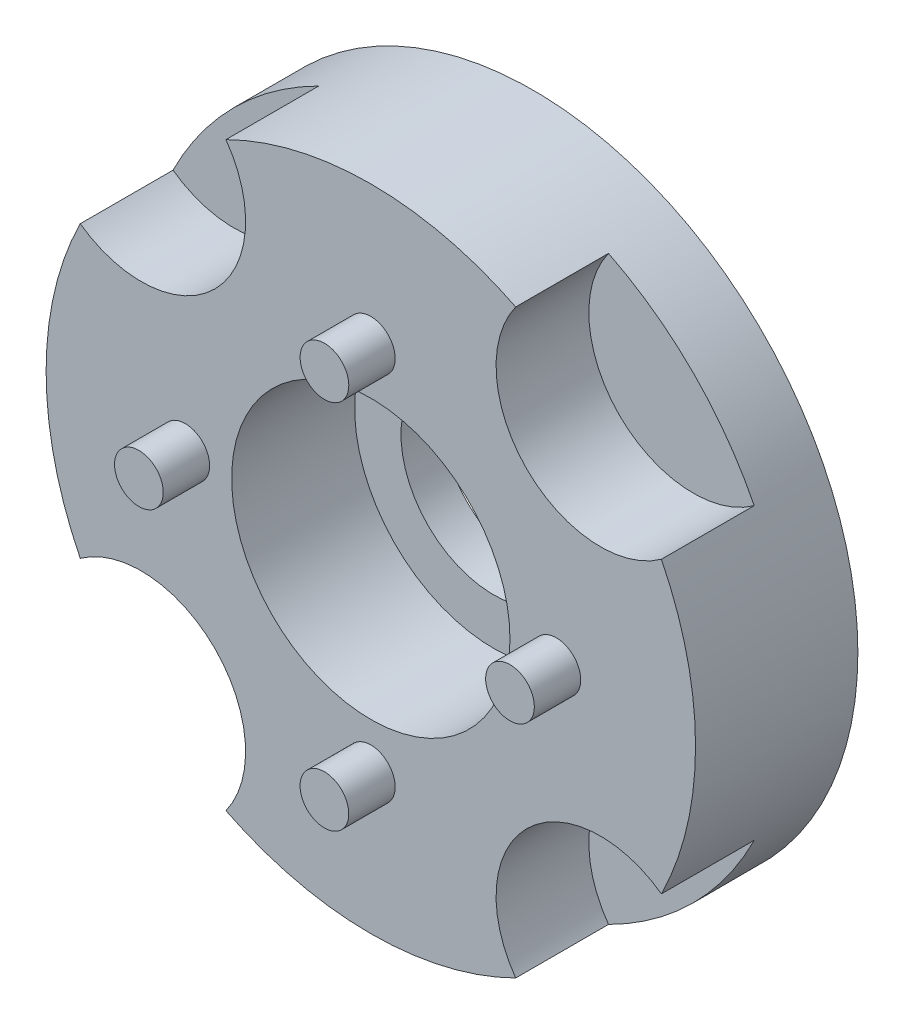
ISO-10303-21;
HEADER;
FILE_DESCRIPTION(('STEP AP214'),'2;1');
FILE_NAME('part.step','',(''),(''),'','','');
FILE_SCHEMA(('AUTOMOTIVE_DESIGN { 1 0 10303 214 1 1 1 1 }'));
ENDSEC;
DATA;
#1=APPLICATION_CONTEXT('core data for automotive mechanical design processes');
#2=APPLICATION_PROTOCOL_DEFINITION('international standard','automotive_design',2000,#1);
#3=PRODUCT_CONTEXT('',#1,'mechanical');
#4=PRODUCT('Part','Part','',(#3));
#5=PRODUCT_RELATED_PRODUCT_CATEGORY('part','',(#4));
#6=PRODUCT_DEFINITION_FORMATION('','',#4);
#7=PRODUCT_DEFINITION_CONTEXT('part definition',#1,'design');
#8=PRODUCT_DEFINITION('design','',#6,#7);
#9=PRODUCT_DEFINITION_SHAPE('','',#8);
#10=(LENGTH_UNIT() NAMED_UNIT(*) SI_UNIT(.MILLI.,.METRE.));
#11=(NAMED_UNIT(*) PLANE_ANGLE_UNIT() SI_UNIT($,.RADIAN.));
#12=(NAMED_UNIT(*) SI_UNIT($,.STERADIAN.) SOLID_ANGLE_UNIT());
#13=UNCERTAINTY_MEASURE_WITH_UNIT(LENGTH_MEASURE(1.E-05),#10,'distance_accuracy_value','');
#14=(GEOMETRIC_REPRESENTATION_CONTEXT(3) GLOBAL_UNCERTAINTY_ASSIGNED_CONTEXT((#13)) GLOBAL_UNIT_ASSIGNED_CONTEXT((#10,
#11,#12)) REPRESENTATION_CONTEXT('',''));
#15=CARTESIAN_POINT('',(0.,0.,0.));
#16=DIRECTION('',(0.,0.,1.));
#17=DIRECTION('',(1.,0.,0.));
#18=AXIS2_PLACEMENT_3D('',#15,#16,#17);
#19=CARTESIAN_POINT('',(0.,0.,3.5));
#20=DIRECTION('',(0.,0.,-1.));
#21=DIRECTION('',(-1.,0.,0.));
#22=AXIS2_PLACEMENT_3D('',#19,#20,#21);
#23=CYLINDRICAL_SURFACE('',#22,7.);
#24=CARTESIAN_POINT('',(0.,0.,1.5));
#25=DIRECTION('',(0.,0.,1.));
#26=DIRECTION('',(1.,0.,0.));
#27=AXIS2_PLACEMENT_3D('',#24,#25,#26);
#28=CIRCLE('',#27,7.);
#29=CARTESIAN_POINT('',(-6.26436153593715,-3.12374367499499,1.5));
#30=VERTEX_POINT('',#29);
#31=CARTESIAN_POINT('',(-3.12374367499488,-6.2643615359372,1.5));
#32=VERTEX_POINT('',#31);
#33=EDGE_CURVE('E11',#30,#32,#28,.T.);
#34=ORIENTED_EDGE('',*,*,#33,.F.);
#35=DIRECTION('',(0.,0.,1.));
#36=VECTOR('',#35,1.);
#37=CARTESIAN_POINT('',(-6.26436153593714,-3.12374367499499,2.5));
#38=LINE('',#37,#36);
#39=CARTESIAN_POINT('',(-6.26436153593714,-3.12374367499499,3.5));
#40=VERTEX_POINT('',#39);
#41=EDGE_CURVE('E183',#30,#40,#38,.T.);
#42=ORIENTED_EDGE('',*,*,#41,.T.);
#43=CARTESIAN_POINT('',(0.,0.,3.5));
#44=DIRECTION('',(0.,0.,1.));
#45=DIRECTION('',(1.,0.,0.));
#46=AXIS2_PLACEMENT_3D('',#43,#44,#45);
#47=CIRCLE('',#46,7.);
#48=CARTESIAN_POINT('',(-6.26436153593719,3.1237436749949,3.5));
#49=VERTEX_POINT('',#48);
#50=EDGE_CURVE('E130',#49,#40,#47,.T.);
#51=ORIENTED_EDGE('',*,*,#50,.F.);
#52=DIRECTION('',(0.,0.,1.));
#53=VECTOR('',#52,1.);
#54=CARTESIAN_POINT('',(-6.26436153593719,3.1237436749949,2.5));
#55=LINE('',#54,#53);
#56=CARTESIAN_POINT('',(-6.26436153593719,3.1237436749949,1.5));
#57=VERTEX_POINT('',#56);
#58=EDGE_CURVE('E177',#49,#57,#55,.F.);
#59=ORIENTED_EDGE('',*,*,#58,.T.);
#60=CARTESIAN_POINT('',(0.,0.,1.5));
#61=DIRECTION('',(0.,0.,1.));
#62=DIRECTION('',(1.,0.,0.));
#63=AXIS2_PLACEMENT_3D('',#60,#61,#62);
#64=CIRCLE('',#63,7.);
#65=CARTESIAN_POINT('',(-3.12374367499497,6.26436153593716,1.5));
#66=VERTEX_POINT('',#65);
#67=EDGE_CURVE('E125',#66,#57,#64,.T.);
#68=ORIENTED_EDGE('',*,*,#67,.F.);
#69=DIRECTION('',(0.,0.,1.));
#70=VECTOR('',#69,1.);
#71=CARTESIAN_POINT('',(-3.12374367499497,6.26436153593716,2.5));
#72=LINE('',#71,#70);
#73=CARTESIAN_POINT('',(-3.12374367499497,6.26436153593716,3.5));
#74=VERTEX_POINT('',#73);
#75=EDGE_CURVE('E172',#66,#74,#72,.T.);
#76=ORIENTED_EDGE('',*,*,#75,.T.);
#77=CARTESIAN_POINT('',(3.12374367499484,6.26436153593722,3.5));
#78=VERTEX_POINT('',#77);
#79=EDGE_CURVE('E139',#78,#74,#47,.T.);
#80=ORIENTED_EDGE('',*,*,#79,.F.);
#81=DIRECTION('',(0.,0.,1.));
#82=VECTOR('',#81,1.);
#83=CARTESIAN_POINT('',(3.12374367499484,6.26436153593722,2.5));
#84=LINE('',#83,#82);
#85=CARTESIAN_POINT('',(3.12374367499484,6.26436153593722,1.5));
#86=VERTEX_POINT('',#85);
#87=EDGE_CURVE('E51',#78,#86,#84,.F.);
#88=ORIENTED_EDGE('',*,*,#87,.T.);
#89=CARTESIAN_POINT('',(0.,0.,1.5));
#90=DIRECTION('',(0.,0.,1.));
#91=DIRECTION('',(1.,0.,0.));
#92=AXIS2_PLACEMENT_3D('',#89,#90,#91);
#93=CIRCLE('',#92,7.);
#94=CARTESIAN_POINT('',(6.26436153593712,3.12374367499504,1.5));
#95=VERTEX_POINT('',#94);
#96=EDGE_CURVE('E112',#95,#86,#93,.T.);
#97=ORIENTED_EDGE('',*,*,#96,.F.);
#98=DIRECTION('',(0.,0.,1.));
#99=VECTOR('',#98,1.);
#100=CARTESIAN_POINT('',(6.26436153593712,3.12374367499503,2.5));
#101=LINE('',#100,#99);
#102=CARTESIAN_POINT('',(6.26436153593712,3.12374367499504,3.5));
#103=VERTEX_POINT('',#102);
#104=EDGE_CURVE('E100',#95,#103,#101,.T.);
#105=ORIENTED_EDGE('',*,*,#104,.T.);
#106=CARTESIAN_POINT('',(6.26436153593719,-3.1237436749949,3.5));
#107=VERTEX_POINT('',#106);
#108=EDGE_CURVE('E468',#107,#103,#47,.T.);
#109=ORIENTED_EDGE('',*,*,#108,.F.);
#110=DIRECTION('',(0.,0.,1.));
#111=VECTOR('',#110,1.);
#112=CARTESIAN_POINT('',(6.26436153593719,-3.1237436749949,2.5));
#113=LINE('',#112,#111);
#114=CARTESIAN_POINT('',(6.26436153593719,-3.1237436749949,1.5));
#115=VERTEX_POINT('',#114);
#116=EDGE_CURVE('E59',#107,#115,#113,.F.);
#117=ORIENTED_EDGE('',*,*,#116,.T.);
#118=CARTESIAN_POINT('',(0.,0.,1.5));
#119=DIRECTION('',(0.,0.,1.));
#120=DIRECTION('',(1.,0.,0.));
#121=AXIS2_PLACEMENT_3D('',#118,#119,#120);
#122=CIRCLE('',#121,7.);
#123=CARTESIAN_POINT('',(3.12374367499497,-6.26436153593716,1.5));
#124=VERTEX_POINT('',#123);
#125=EDGE_CURVE('E44',#124,#115,#122,.T.);
#126=ORIENTED_EDGE('',*,*,#125,.F.);
#127=DIRECTION('',(0.,0.,1.));
#128=VECTOR('',#127,1.);
#129=CARTESIAN_POINT('',(3.12374367499497,-6.26436153593716,2.5));
#130=LINE('',#129,#128);
#131=CARTESIAN_POINT('',(3.12374367499497,-6.26436153593716,3.5));
#132=VERTEX_POINT('',#131);
#133=EDGE_CURVE('E189',#124,#132,#130,.T.);
#134=ORIENTED_EDGE('',*,*,#133,.T.);
#135=CARTESIAN_POINT('',(-3.12374367499488,-6.2643615359372,3.5));
#136=VERTEX_POINT('',#135);
#137=EDGE_CURVE('E143',#136,#132,#47,.T.);
#138=ORIENTED_EDGE('',*,*,#137,.F.);
#139=DIRECTION('',(0.,0.,1.));
#140=VECTOR('',#139,1.);
#141=CARTESIAN_POINT('',(-3.12374367499488,-6.2643615359372,2.5));
#142=LINE('',#141,#140);
#143=EDGE_CURVE('E186',#136,#32,#142,.F.);
#144=ORIENTED_EDGE('',*,*,#143,.T.);
#145=EDGE_LOOP('',(#34,#42,#51,#59,#68,#76,#80,#88,#97,#105,#109,#117,#126,#134,#138,#144));
#146=FACE_BOUND('',#145,.T.);
#147=CARTESIAN_POINT('',(0.,0.,0.));
#148=DIRECTION('',(0.,0.,1.));
#149=DIRECTION('',(1.,0.,0.));
#150=AXIS2_PLACEMENT_3D('',#147,#148,#149);
#151=CIRCLE('',#150,7.);
#152=CARTESIAN_POINT('',(7.,0.,0.));
#153=VERTEX_POINT('',#152);
#154=EDGE_CURVE('E136',#153,#153,#151,.T.);
#155=ORIENTED_EDGE('',*,*,#154,.T.);
#156=EDGE_LOOP('',(#155));
#157=FACE_BOUND('',#156,.T.);
#158=ADVANCED_FACE('F37',(#146,#157),#23,.T.);
#159=CARTESIAN_POINT('',(0.,0.,3.5));
#160=DIRECTION('',(0.,0.,1.));
#161=DIRECTION('',(1.,0.,0.));
#162=AXIS2_PLACEMENT_3D('',#159,#160,#161);
#163=PLANE('',#162);
#164=CARTESIAN_POINT('',(-4.94974746830579,-4.94974746830588,3.5));
#165=DIRECTION('',(0.,0.,1.));
#166=DIRECTION('',(1.,0.,0.));
#167=AXIS2_PLACEMENT_3D('',#164,#165,#166);
#168=CIRCLE('',#167,2.25);
#169=EDGE_CURVE('E118',#136,#40,#168,.T.);
#170=ORIENTED_EDGE('',*,*,#169,.F.);
#171=ORIENTED_EDGE('',*,*,#137,.T.);
#172=CARTESIAN_POINT('',(4.94974746830586,-4.94974746830581,3.5));
#173=DIRECTION('',(0.,0.,1.));
#174=DIRECTION('',(1.,0.,0.));
#175=AXIS2_PLACEMENT_3D('',#172,#173,#174);
#176=CIRCLE('',#175,2.25);
#177=EDGE_CURVE('E120',#107,#132,#176,.T.);
#178=ORIENTED_EDGE('',*,*,#177,.F.);
#179=ORIENTED_EDGE('',*,*,#108,.T.);
#180=CARTESIAN_POINT('',(4.94974746830575,4.94974746830591,3.5));
#181=DIRECTION('',(0.,0.,1.));
#182=DIRECTION('',(1.,0.,0.));
#183=AXIS2_PLACEMENT_3D('',#180,#181,#182);
#184=CIRCLE('',#183,2.25);
#185=EDGE_CURVE('E104',#78,#103,#184,.T.);
#186=ORIENTED_EDGE('',*,*,#185,.F.);
#187=ORIENTED_EDGE('',*,*,#79,.T.);
#188=CARTESIAN_POINT('',(-4.94974746830586,4.94974746830581,3.5));
#189=DIRECTION('',(0.,0.,1.));
#190=DIRECTION('',(1.,0.,0.));
#191=AXIS2_PLACEMENT_3D('',#188,#189,#190);
#192=CIRCLE('',#191,2.25);
#193=EDGE_CURVE('E127',#49,#74,#192,.T.);
#194=ORIENTED_EDGE('',*,*,#193,.F.);
#195=ORIENTED_EDGE('',*,*,#50,.T.);
#196=EDGE_LOOP('',(#170,#171,#178,#179,#186,#187,#194,#195));
#197=FACE_BOUND('',#196,.T.);
#198=CARTESIAN_POINT('',(0.,0.,3.5));
#199=DIRECTION('',(0.,0.,1.));
#200=DIRECTION('',(1.,0.,0.));
#201=AXIS2_PLACEMENT_3D('',#198,#199,#200);
#202=CIRCLE('',#201,3.);
#203=CARTESIAN_POINT('',(3.,0.,3.5));
#204=VERTEX_POINT('',#203);
#205=EDGE_CURVE('E131',#204,#204,#202,.F.);
#206=ORIENTED_EDGE('',*,*,#205,.T.);
#207=EDGE_LOOP('',(#206));
#208=FACE_BOUND('',#207,.T.);
#209=CARTESIAN_POINT('',(4.,0.,3.5));
#210=DIRECTION('',(0.,0.,1.));
#211=DIRECTION('',(0.,-1.,0.));
#212=AXIS2_PLACEMENT_3D('',#209,#210,#211);
#213=CIRCLE('',#212,0.525);
#214=CARTESIAN_POINT('',(4.00000000000001,-0.524999999999958,3.5));
#215=VERTEX_POINT('',#214);
#216=EDGE_CURVE('E134',#215,#215,#213,.T.);
#217=ORIENTED_EDGE('',*,*,#216,.F.);
#218=EDGE_LOOP('',(#217));
#219=FACE_BOUND('',#218,.T.);
#220=CARTESIAN_POINT('',(0.,-4.,3.5));
#221=DIRECTION('',(0.,0.,1.));
#222=DIRECTION('',(-1.,0.,0.));
#223=AXIS2_PLACEMENT_3D('',#220,#221,#222);
#224=CIRCLE('',#223,0.525);
#225=CARTESIAN_POINT('',(-0.525,-4.,3.5));
#226=VERTEX_POINT('',#225);
#227=EDGE_CURVE('E156',#226,#226,#224,.T.);
#228=ORIENTED_EDGE('',*,*,#227,.F.);
#229=EDGE_LOOP('',(#228));
#230=FACE_BOUND('',#229,.T.);
#231=CARTESIAN_POINT('',(-4.,0.,3.5));
#232=DIRECTION('',(0.,0.,1.));
#233=DIRECTION('',(0.,1.,0.));
#234=AXIS2_PLACEMENT_3D('',#231,#232,#233);
#235=CIRCLE('',#234,0.525);
#236=CARTESIAN_POINT('',(-4.,0.524999999999986,3.5));
#237=VERTEX_POINT('',#236);
#238=EDGE_CURVE('E150',#237,#237,#235,.T.);
#239=ORIENTED_EDGE('',*,*,#238,.F.);
#240=EDGE_LOOP('',(#239));
#241=FACE_BOUND('',#240,.T.);
#242=CARTESIAN_POINT('',(0.,4.,3.5));
#243=DIRECTION('',(0.,0.,1.));
#244=DIRECTION('',(1.,0.,0.));
#245=AXIS2_PLACEMENT_3D('',#242,#243,#244);
#246=CIRCLE('',#245,0.525);
#247=CARTESIAN_POINT('',(0.525,4.,3.5));
#248=VERTEX_POINT('',#247);
#249=EDGE_CURVE('E144',#248,#248,#246,.T.);
#250=ORIENTED_EDGE('',*,*,#249,.F.);
#251=EDGE_LOOP('',(#250));
#252=FACE_BOUND('',#251,.T.);
#253=ADVANCED_FACE('F208',(#197,#208,#219,#230,#241,#252),#163,.T.);
#254=CARTESIAN_POINT('',(0.,0.,0.));
#255=DIRECTION('',(0.,0.,1.));
#256=DIRECTION('',(1.,0.,0.));
#257=AXIS2_PLACEMENT_3D('',#254,#255,#256);
#258=PLANE('',#257);
#259=CARTESIAN_POINT('',(0.,0.,0.));
#260=DIRECTION('',(0.,0.,1.));
#261=DIRECTION('',(1.,0.,0.));
#262=AXIS2_PLACEMENT_3D('',#259,#260,#261);
#263=CIRCLE('',#262,2.);
#264=CARTESIAN_POINT('',(2.,0.,0.));
#265=VERTEX_POINT('',#264);
#266=EDGE_CURVE('E168',#265,#265,#263,.T.);
#267=ORIENTED_EDGE('',*,*,#266,.T.);
#268=EDGE_LOOP('',(#267));
#269=FACE_BOUND('',#268,.T.);
#270=ORIENTED_EDGE('',*,*,#154,.F.);
#271=EDGE_LOOP('',(#270));
#272=FACE_BOUND('',#271,.T.);
#273=ADVANCED_FACE('F233',(#269,#272),#258,.F.);
#274=CARTESIAN_POINT('',(0.,4.,4.5));
#275=DIRECTION('',(0.,0.,-1.));
#276=DIRECTION('',(-1.,0.,0.));
#277=AXIS2_PLACEMENT_3D('',#274,#275,#276);
#278=CYLINDRICAL_SURFACE('',#277,0.525);
#279=CARTESIAN_POINT('',(0.,4.,4.5));
#280=DIRECTION('',(0.,0.,1.));
#281=DIRECTION('',(1.,0.,0.));
#282=AXIS2_PLACEMENT_3D('',#279,#280,#281);
#283=CIRCLE('',#282,0.525);
#284=CARTESIAN_POINT('',(0.525,4.,4.5));
#285=VERTEX_POINT('',#284);
#286=EDGE_CURVE('E140',#285,#285,#283,.T.);
#287=ORIENTED_EDGE('',*,*,#286,.F.);
#288=EDGE_LOOP('',(#287));
#289=FACE_BOUND('',#288,.T.);
#290=ORIENTED_EDGE('',*,*,#249,.T.);
#291=EDGE_LOOP('',(#290));
#292=FACE_BOUND('',#291,.T.);
#293=ADVANCED_FACE('F238',(#289,#292),#278,.T.);
#294=CARTESIAN_POINT('',(0.,4.,4.5));
#295=DIRECTION('',(0.,0.,1.));
#296=DIRECTION('',(1.,0.,0.));
#297=AXIS2_PLACEMENT_3D('',#294,#295,#296);
#298=PLANE('',#297);
#299=ORIENTED_EDGE('',*,*,#286,.T.);
#300=EDGE_LOOP('',(#299));
#301=FACE_BOUND('',#300,.T.);
#302=ADVANCED_FACE('F243',(#301),#298,.T.);
#303=CARTESIAN_POINT('',(-4.,0.,4.5));
#304=DIRECTION('',(0.,0.,-1.));
#305=DIRECTION('',(-1.,0.,0.));
#306=AXIS2_PLACEMENT_3D('',#303,#304,#305);
#307=CYLINDRICAL_SURFACE('',#306,0.525);
#308=CARTESIAN_POINT('',(-4.,0.,4.5));
#309=DIRECTION('',(0.,0.,1.));
#310=DIRECTION('',(0.,1.,0.));
#311=AXIS2_PLACEMENT_3D('',#308,#309,#310);
#312=CIRCLE('',#311,0.525);
#313=CARTESIAN_POINT('',(-4.,0.524999999999986,4.5));
#314=VERTEX_POINT('',#313);
#315=EDGE_CURVE('E147',#314,#314,#312,.T.);
#316=ORIENTED_EDGE('',*,*,#315,.F.);
#317=EDGE_LOOP('',(#316));
#318=FACE_BOUND('',#317,.T.);
#319=ORIENTED_EDGE('',*,*,#238,.T.);
#320=EDGE_LOOP('',(#319));
#321=FACE_BOUND('',#320,.T.);
#322=ADVANCED_FACE('F247',(#318,#321),#307,.T.);
#323=CARTESIAN_POINT('',(-4.,0.,4.5));
#324=DIRECTION('',(0.,0.,1.));
#325=DIRECTION('',(0.,1.,0.));
#326=AXIS2_PLACEMENT_3D('',#323,#324,#325);
#327=PLANE('',#326);
#328=ORIENTED_EDGE('',*,*,#315,.T.);
#329=EDGE_LOOP('',(#328));
#330=FACE_BOUND('',#329,.T.);
#331=ADVANCED_FACE('F251',(#330),#327,.T.);
#332=CARTESIAN_POINT('',(0.,-4.,4.5));
#333=DIRECTION('',(0.,0.,-1.));
#334=DIRECTION('',(-1.,0.,0.));
#335=AXIS2_PLACEMENT_3D('',#332,#333,#334);
#336=CYLINDRICAL_SURFACE('',#335,0.525);
#337=CARTESIAN_POINT('',(0.,-4.,4.5));
#338=DIRECTION('',(0.,0.,1.));
#339=DIRECTION('',(-1.,0.,0.));
#340=AXIS2_PLACEMENT_3D('',#337,#338,#339);
#341=CIRCLE('',#340,0.525);
#342=CARTESIAN_POINT('',(-0.525,-4.,4.5));
#343=VERTEX_POINT('',#342);
#344=EDGE_CURVE('E153',#343,#343,#341,.T.);
#345=ORIENTED_EDGE('',*,*,#344,.F.);
#346=EDGE_LOOP('',(#345));
#347=FACE_BOUND('',#346,.T.);
#348=ORIENTED_EDGE('',*,*,#227,.T.);
#349=EDGE_LOOP('',(#348));
#350=FACE_BOUND('',#349,.T.);
#351=ADVANCED_FACE('F255',(#347,#350),#336,.T.);
#352=CARTESIAN_POINT('',(0.,-4.,4.5));
#353=DIRECTION('',(0.,0.,1.));
#354=DIRECTION('',(-1.,0.,0.));
#355=AXIS2_PLACEMENT_3D('',#352,#353,#354);
#356=PLANE('',#355);
#357=ORIENTED_EDGE('',*,*,#344,.T.);
#358=EDGE_LOOP('',(#357));
#359=FACE_BOUND('',#358,.T.);
#360=ADVANCED_FACE('F259',(#359),#356,.T.);
#361=CARTESIAN_POINT('',(4.,0.,4.5));
#362=DIRECTION('',(0.,0.,-1.));
#363=DIRECTION('',(-1.,0.,0.));
#364=AXIS2_PLACEMENT_3D('',#361,#362,#363);
#365=CYLINDRICAL_SURFACE('',#364,0.525);
#366=CARTESIAN_POINT('',(4.,0.,4.5));
#367=DIRECTION('',(0.,0.,1.));
#368=DIRECTION('',(0.,-1.,0.));
#369=AXIS2_PLACEMENT_3D('',#366,#367,#368);
#370=CIRCLE('',#369,0.525);
#371=CARTESIAN_POINT('',(4.00000000000001,-0.524999999999958,4.5));
#372=VERTEX_POINT('',#371);
#373=EDGE_CURVE('E159',#372,#372,#370,.T.);
#374=ORIENTED_EDGE('',*,*,#373,.F.);
#375=EDGE_LOOP('',(#374));
#376=FACE_BOUND('',#375,.T.);
#377=ORIENTED_EDGE('',*,*,#216,.T.);
#378=EDGE_LOOP('',(#377));
#379=FACE_BOUND('',#378,.T.);
#380=ADVANCED_FACE('F263',(#376,#379),#365,.T.);
#381=CARTESIAN_POINT('',(4.,0.,4.5));
#382=DIRECTION('',(0.,0.,1.));
#383=DIRECTION('',(0.,-1.,0.));
#384=AXIS2_PLACEMENT_3D('',#381,#382,#383);
#385=PLANE('',#384);
#386=ORIENTED_EDGE('',*,*,#373,.T.);
#387=EDGE_LOOP('',(#386));
#388=FACE_BOUND('',#387,.T.);
#389=ADVANCED_FACE('F267',(#388),#385,.T.);
#390=CARTESIAN_POINT('',(0.,0.,4.5));
#391=DIRECTION('',(0.,0.,-1.));
#392=DIRECTION('',(-1.,0.,0.));
#393=AXIS2_PLACEMENT_3D('',#390,#391,#392);
#394=CYLINDRICAL_SURFACE('',#393,3.);
#395=ORIENTED_EDGE('',*,*,#205,.F.);
#396=EDGE_LOOP('',(#395));
#397=FACE_BOUND('',#396,.T.);
#398=CARTESIAN_POINT('',(0.,0.,0.85));
#399=DIRECTION('',(0.,0.,1.));
#400=DIRECTION('',(1.,0.,0.));
#401=AXIS2_PLACEMENT_3D('',#398,#399,#400);
#402=CIRCLE('',#401,3.);
#403=CARTESIAN_POINT('',(3.,0.,0.85));
#404=VERTEX_POINT('',#403);
#405=EDGE_CURVE('E135',#404,#404,#402,.T.);
#406=ORIENTED_EDGE('',*,*,#405,.F.);
#407=EDGE_LOOP('',(#406));
#408=FACE_BOUND('',#407,.T.);
#409=ADVANCED_FACE('F271',(#397,#408),#394,.F.);
#410=CARTESIAN_POINT('',(0.,0.,0.85));
#411=DIRECTION('',(0.,0.,1.));
#412=DIRECTION('',(1.,0.,0.));
#413=AXIS2_PLACEMENT_3D('',#410,#411,#412);
#414=PLANE('',#413);
#415=CARTESIAN_POINT('',(0.,0.,0.85));
#416=DIRECTION('',(0.,0.,1.));
#417=DIRECTION('',(1.,0.,0.));
#418=AXIS2_PLACEMENT_3D('',#415,#416,#417);
#419=CIRCLE('',#418,2.);
#420=CARTESIAN_POINT('',(2.,0.,0.85));
#421=VERTEX_POINT('',#420);
#422=EDGE_CURVE('E169',#421,#421,#419,.T.);
#423=ORIENTED_EDGE('',*,*,#422,.F.);
#424=EDGE_LOOP('',(#423));
#425=FACE_BOUND('',#424,.T.);
#426=ORIENTED_EDGE('',*,*,#405,.T.);
#427=EDGE_LOOP('',(#426));
#428=FACE_BOUND('',#427,.T.);
#429=ADVANCED_FACE('F225',(#425,#428),#414,.T.);
#430=CARTESIAN_POINT('',(0.,0.,0.));
#431=DIRECTION('',(0.,0.,1.));
#432=DIRECTION('',(1.,0.,0.));
#433=AXIS2_PLACEMENT_3D('',#430,#431,#432);
#434=CYLINDRICAL_SURFACE('',#433,2.);
#435=ORIENTED_EDGE('',*,*,#266,.F.);
#436=EDGE_LOOP('',(#435));
#437=FACE_BOUND('',#436,.T.);
#438=ORIENTED_EDGE('',*,*,#422,.T.);
#439=EDGE_LOOP('',(#438));
#440=FACE_BOUND('',#439,.T.);
#441=ADVANCED_FACE('F218',(#437,#440),#434,.F.);
#442=CARTESIAN_POINT('',(-4.94974746830586,4.94974746830581,1.5));
#443=DIRECTION('',(0.,0.,1.));
#444=DIRECTION('',(1.,0.,0.));
#445=AXIS2_PLACEMENT_3D('',#442,#443,#444);
#446=PLANE('',#445);
#447=ORIENTED_EDGE('',*,*,#67,.T.);
#448=CARTESIAN_POINT('',(-4.94974746830586,4.94974746830581,1.5));
#449=DIRECTION('',(0.,0.,1.));
#450=DIRECTION('',(1.,0.,0.));
#451=AXIS2_PLACEMENT_3D('',#448,#449,#450);
#452=CIRCLE('',#451,2.25);
#453=EDGE_CURVE('E180',#57,#66,#452,.T.);
#454=ORIENTED_EDGE('',*,*,#453,.T.);
#455=EDGE_LOOP('',(#447,#454));
#456=FACE_BOUND('',#455,.T.);
#457=ADVANCED_FACE('F216',(#456),#446,.T.);
#458=CARTESIAN_POINT('',(-4.94974746830586,4.94974746830581,1.5));
#459=DIRECTION('',(0.,0.,1.));
#460=DIRECTION('',(1.,0.,0.));
#461=AXIS2_PLACEMENT_3D('',#458,#459,#460);
#462=CYLINDRICAL_SURFACE('',#461,2.25);
#463=ORIENTED_EDGE('',*,*,#453,.F.);
#464=ORIENTED_EDGE('',*,*,#58,.F.);
#465=ORIENTED_EDGE('',*,*,#193,.T.);
#466=ORIENTED_EDGE('',*,*,#75,.F.);
#467=EDGE_LOOP('',(#463,#464,#465,#466));
#468=FACE_BOUND('',#467,.T.);
#469=ADVANCED_FACE('F214',(#468),#462,.F.);
#470=CARTESIAN_POINT('',(4.94974746830575,4.94974746830591,1.5));
#471=DIRECTION('',(0.,0.,1.));
#472=DIRECTION('',(0.,-1.,0.));
#473=AXIS2_PLACEMENT_3D('',#470,#471,#472);
#474=PLANE('',#473);
#475=ORIENTED_EDGE('',*,*,#96,.T.);
#476=CARTESIAN_POINT('',(4.94974746830575,4.94974746830591,1.5));
#477=DIRECTION('',(0.,0.,1.));
#478=DIRECTION('',(0.,-1.,0.));
#479=AXIS2_PLACEMENT_3D('',#476,#477,#478);
#480=CIRCLE('',#479,2.25);
#481=EDGE_CURVE('E103',#86,#95,#480,.T.);
#482=ORIENTED_EDGE('',*,*,#481,.T.);
#483=EDGE_LOOP('',(#475,#482));
#484=FACE_BOUND('',#483,.T.);
#485=ADVANCED_FACE('F111',(#484),#474,.T.);
#486=CARTESIAN_POINT('',(4.94974746830575,4.94974746830591,1.5));
#487=DIRECTION('',(0.,0.,1.));
#488=DIRECTION('',(1.,0.,0.));
#489=AXIS2_PLACEMENT_3D('',#486,#487,#488);
#490=CYLINDRICAL_SURFACE('',#489,2.25);
#491=ORIENTED_EDGE('',*,*,#481,.F.);
#492=ORIENTED_EDGE('',*,*,#87,.F.);
#493=ORIENTED_EDGE('',*,*,#185,.T.);
#494=ORIENTED_EDGE('',*,*,#104,.F.);
#495=EDGE_LOOP('',(#491,#492,#493,#494));
#496=FACE_BOUND('',#495,.T.);
#497=ADVANCED_FACE('F102',(#496),#490,.F.);
#498=CARTESIAN_POINT('',(4.94974746830586,-4.94974746830581,1.5));
#499=DIRECTION('',(0.,0.,1.));
#500=DIRECTION('',(-1.,0.,0.));
#501=AXIS2_PLACEMENT_3D('',#498,#499,#500);
#502=PLANE('',#501);
#503=ORIENTED_EDGE('',*,*,#125,.T.);
#504=CARTESIAN_POINT('',(4.94974746830586,-4.94974746830581,1.5));
#505=DIRECTION('',(0.,0.,1.));
#506=DIRECTION('',(-1.,0.,0.));
#507=AXIS2_PLACEMENT_3D('',#504,#505,#506);
#508=CIRCLE('',#507,2.25);
#509=EDGE_CURVE('E113',#115,#124,#508,.T.);
#510=ORIENTED_EDGE('',*,*,#509,.T.);
#511=EDGE_LOOP('',(#503,#510));
#512=FACE_BOUND('',#511,.T.);
#513=ADVANCED_FACE('F334',(#512),#502,.T.);
#514=CARTESIAN_POINT('',(4.94974746830586,-4.94974746830581,1.5));
#515=DIRECTION('',(0.,0.,1.));
#516=DIRECTION('',(1.,0.,0.));
#517=AXIS2_PLACEMENT_3D('',#514,#515,#516);
#518=CYLINDRICAL_SURFACE('',#517,2.25);
#519=ORIENTED_EDGE('',*,*,#509,.F.);
#520=ORIENTED_EDGE('',*,*,#116,.F.);
#521=ORIENTED_EDGE('',*,*,#177,.T.);
#522=ORIENTED_EDGE('',*,*,#133,.F.);
#523=EDGE_LOOP('',(#519,#520,#521,#522));
#524=FACE_BOUND('',#523,.T.);
#525=ADVANCED_FACE('F343',(#524),#518,.F.);
#526=CARTESIAN_POINT('',(-4.94974746830579,-4.94974746830588,1.5));
#527=DIRECTION('',(0.,0.,1.));
#528=DIRECTION('',(0.,1.,0.));
#529=AXIS2_PLACEMENT_3D('',#526,#527,#528);
#530=PLANE('',#529);
#531=ORIENTED_EDGE('',*,*,#33,.T.);
#532=CARTESIAN_POINT('',(-4.94974746830579,-4.94974746830588,1.5));
#533=DIRECTION('',(0.,0.,1.));
#534=DIRECTION('',(0.,1.,0.));
#535=AXIS2_PLACEMENT_3D('',#532,#533,#534);
#536=CIRCLE('',#535,2.25);
#537=EDGE_CURVE('E193',#32,#30,#536,.T.);
#538=ORIENTED_EDGE('',*,*,#537,.T.);
#539=EDGE_LOOP('',(#531,#538));
#540=FACE_BOUND('',#539,.T.);
#541=ADVANCED_FACE('F200',(#540),#530,.T.);
#542=CARTESIAN_POINT('',(-4.94974746830579,-4.94974746830588,1.5));
#543=DIRECTION('',(0.,0.,1.));
#544=DIRECTION('',(1.,0.,0.));
#545=AXIS2_PLACEMENT_3D('',#542,#543,#544);
#546=CYLINDRICAL_SURFACE('',#545,2.25);
#547=ORIENTED_EDGE('',*,*,#537,.F.);
#548=ORIENTED_EDGE('',*,*,#143,.F.);
#549=ORIENTED_EDGE('',*,*,#169,.T.);
#550=ORIENTED_EDGE('',*,*,#41,.F.);
#551=EDGE_LOOP('',(#547,#548,#549,#550));
#552=FACE_BOUND('',#551,.T.);
#553=ADVANCED_FACE('F206',(#552),#546,.F.);
#554=CLOSED_SHELL('',(#158,#253,#273,#293,#302,#322,#331,#351,#360,#380,#389,#409,#429,#441,
#457,#469,#485,#497,#513,#525,#541,#553));
#555=MANIFOLD_SOLID_BREP('B2',#554);
#556=ADVANCED_BREP_SHAPE_REPRESENTATION('',(#18,#555),#14);
#557=SHAPE_DEFINITION_REPRESENTATION(#9,#556);
ENDSEC;
END-ISO-10303-21;
